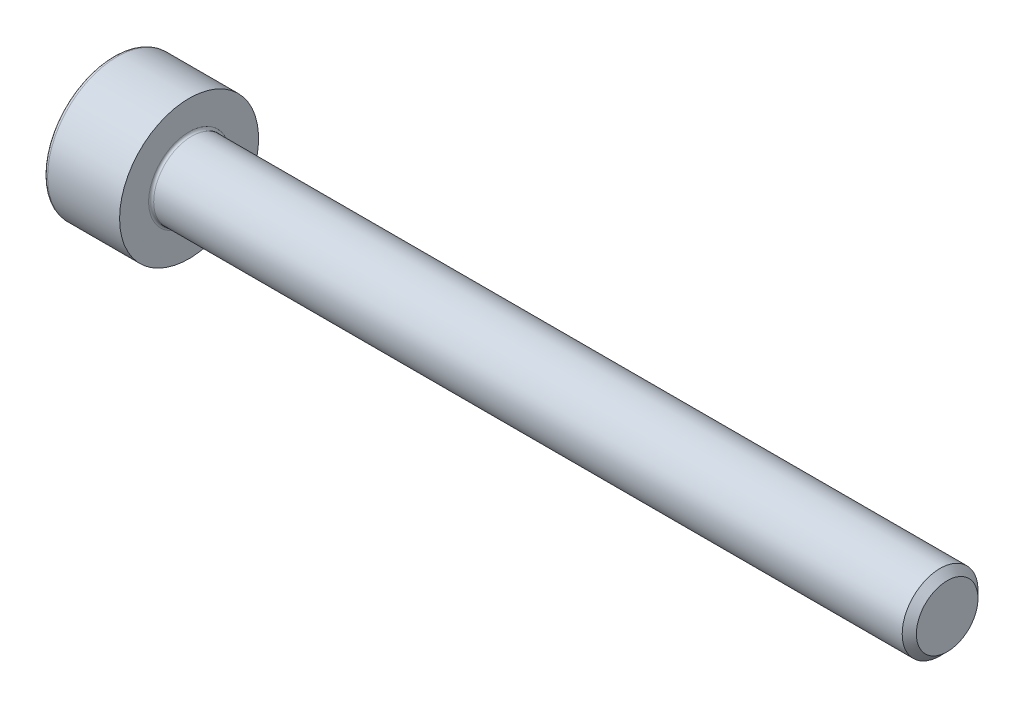
ISO-10303-21;
HEADER;
FILE_DESCRIPTION(('STEP AP214'),'2;1');
FILE_NAME('part.step','',(''),(''),'','','');
FILE_SCHEMA(('AUTOMOTIVE_DESIGN { 1 0 10303 214 1 1 1 1 }'));
ENDSEC;
DATA;
#1=APPLICATION_CONTEXT('core data for automotive mechanical design processes');
#2=APPLICATION_PROTOCOL_DEFINITION('international standard','automotive_design',2000,#1);
#3=PRODUCT_CONTEXT('',#1,'mechanical');
#4=PRODUCT('Part','Part','',(#3));
#5=PRODUCT_RELATED_PRODUCT_CATEGORY('part','',(#4));
#6=PRODUCT_DEFINITION_FORMATION('','',#4);
#7=PRODUCT_DEFINITION_CONTEXT('part definition',#1,'design');
#8=PRODUCT_DEFINITION('design','',#6,#7);
#9=PRODUCT_DEFINITION_SHAPE('','',#8);
#10=(LENGTH_UNIT() NAMED_UNIT(*) SI_UNIT(.MILLI.,.METRE.));
#11=(NAMED_UNIT(*) PLANE_ANGLE_UNIT() SI_UNIT($,.RADIAN.));
#12=(NAMED_UNIT(*) SI_UNIT($,.STERADIAN.) SOLID_ANGLE_UNIT());
#13=UNCERTAINTY_MEASURE_WITH_UNIT(LENGTH_MEASURE(1.E-05),#10,'distance_accuracy_value','');
#14=(GEOMETRIC_REPRESENTATION_CONTEXT(3) GLOBAL_UNCERTAINTY_ASSIGNED_CONTEXT((#13)) GLOBAL_UNIT_ASSIGNED_CONTEXT((#10,
#11,#12)) REPRESENTATION_CONTEXT('',''));
#15=CARTESIAN_POINT('',(0.,0.,0.));
#16=DIRECTION('',(0.,0.,1.));
#17=DIRECTION('',(1.,0.,0.));
#18=AXIS2_PLACEMENT_3D('',#15,#16,#17);
#19=CARTESIAN_POINT('',(0.,0.,0.));
#20=DIRECTION('',(-1.,0.,0.));
#21=DIRECTION('',(0.,0.,1.));
#22=AXIS2_PLACEMENT_3D('',#19,#20,#21);
#23=PLANE('',#22);
#24=DIRECTION('',(0.,-0.499999999999999,0.866025403784439));
#25=VECTOR('',#24,1.);
#26=CARTESIAN_POINT('',(0.,1.47801668912544,0.));
#27=LINE('',#26,#25);
#28=CARTESIAN_POINT('',(0.,1.47801668912544,0.));
#29=VERTEX_POINT('',#28);
#30=CARTESIAN_POINT('',(0.,0.739008344562719,1.28));
#31=VERTEX_POINT('',#30);
#32=EDGE_CURVE('E259',#29,#31,#27,.T.);
#33=ORIENTED_EDGE('',*,*,#32,.T.);
#34=DIRECTION('',(0.,1.,0.));
#35=VECTOR('',#34,1.);
#36=CARTESIAN_POINT('',(0.,-0.739008344562723,1.28));
#37=LINE('',#36,#35);
#38=CARTESIAN_POINT('',(0.,-0.739008344562723,1.28));
#39=VERTEX_POINT('',#38);
#40=EDGE_CURVE('E131',#39,#31,#37,.T.);
#41=ORIENTED_EDGE('',*,*,#40,.F.);
#42=DIRECTION('',(0.,-0.500000000000001,-0.866025403784438));
#43=VECTOR('',#42,1.);
#44=CARTESIAN_POINT('',(0.,-0.739008344562723,1.28));
#45=LINE('',#44,#43);
#46=CARTESIAN_POINT('',(0.,-1.47801668912545,0.));
#47=VERTEX_POINT('',#46);
#48=EDGE_CURVE('E262',#39,#47,#45,.T.);
#49=ORIENTED_EDGE('',*,*,#48,.T.);
#50=DIRECTION('',(0.,0.499999999999999,-0.866025403784439));
#51=VECTOR('',#50,1.);
#52=CARTESIAN_POINT('',(0.,-1.47801668912545,0.));
#53=LINE('',#52,#51);
#54=CARTESIAN_POINT('',(0.,-0.739008344562726,-1.28));
#55=VERTEX_POINT('',#54);
#56=EDGE_CURVE('E265',#47,#55,#53,.T.);
#57=ORIENTED_EDGE('',*,*,#56,.T.);
#58=DIRECTION('',(0.,-1.,0.));
#59=VECTOR('',#58,1.);
#60=CARTESIAN_POINT('',(0.,0.739008344562716,-1.28));
#61=LINE('',#60,#59);
#62=CARTESIAN_POINT('',(0.,0.739008344562716,-1.28));
#63=VERTEX_POINT('',#62);
#64=EDGE_CURVE('E268',#63,#55,#61,.T.);
#65=ORIENTED_EDGE('',*,*,#64,.F.);
#66=DIRECTION('',(0.,-0.500000000000001,-0.866025403784438));
#67=VECTOR('',#66,1.);
#68=CARTESIAN_POINT('',(0.,1.47801668912544,0.));
#69=LINE('',#68,#67);
#70=EDGE_CURVE('E126',#29,#63,#69,.T.);
#71=ORIENTED_EDGE('',*,*,#70,.F.);
#72=EDGE_LOOP('',(#33,#41,#49,#57,#65,#71));
#73=FACE_BOUND('',#72,.T.);
#74=CARTESIAN_POINT('',(0.,0.,0.));
#75=DIRECTION('',(-1.,0.,0.));
#76=DIRECTION('',(0.,0.,1.));
#77=AXIS2_PLACEMENT_3D('',#74,#75,#76);
#78=CIRCLE('',#77,2.6);
#79=CARTESIAN_POINT('',(0.,0.,2.6));
#80=VERTEX_POINT('',#79);
#81=EDGE_CURVE('E43',#80,#80,#78,.T.);
#82=ORIENTED_EDGE('',*,*,#81,.T.);
#83=EDGE_LOOP('',(#82));
#84=FACE_BOUND('',#83,.T.);
#85=ADVANCED_FACE('F35',(#73,#84),#23,.T.);
#86=CARTESIAN_POINT('',(-31.75,0.,0.));
#87=DIRECTION('',(-1.,0.,0.));
#88=DIRECTION('',(0.,0.,1.));
#89=AXIS2_PLACEMENT_3D('',#86,#87,#88);
#90=CYLINDRICAL_SURFACE('',#89,2.75);
#91=CARTESIAN_POINT('',(0.149999999999997,0.,0.));
#92=DIRECTION('',(-1.,0.,0.));
#93=DIRECTION('',(0.,0.,1.));
#94=AXIS2_PLACEMENT_3D('',#91,#92,#93);
#95=CIRCLE('',#94,2.75);
#96=CARTESIAN_POINT('',(0.149999999999997,0.,2.75));
#97=VERTEX_POINT('',#96);
#98=EDGE_CURVE('E11',#97,#97,#95,.F.);
#99=ORIENTED_EDGE('',*,*,#98,.T.);
#100=EDGE_LOOP('',(#99));
#101=FACE_BOUND('',#100,.T.);
#102=CARTESIAN_POINT('',(3.,0.,0.));
#103=DIRECTION('',(-1.,0.,0.));
#104=DIRECTION('',(0.,0.,1.));
#105=AXIS2_PLACEMENT_3D('',#102,#103,#104);
#106=CIRCLE('',#105,2.75);
#107=CARTESIAN_POINT('',(3.,0.,2.75));
#108=VERTEX_POINT('',#107);
#109=EDGE_CURVE('E149',#108,#108,#106,.T.);
#110=ORIENTED_EDGE('',*,*,#109,.T.);
#111=EDGE_LOOP('',(#110));
#112=FACE_BOUND('',#111,.T.);
#113=ADVANCED_FACE('F173',(#101,#112),#90,.T.);
#114=CARTESIAN_POINT('',(3.,2.75,0.));
#115=DIRECTION('',(1.,0.,0.));
#116=DIRECTION('',(0.,0.,-1.));
#117=AXIS2_PLACEMENT_3D('',#114,#115,#116);
#118=PLANE('',#117);
#119=CARTESIAN_POINT('',(3.,0.,0.));
#120=DIRECTION('',(1.,0.,0.));
#121=DIRECTION('',(0.,0.,-1.));
#122=AXIS2_PLACEMENT_3D('',#119,#120,#121);
#123=CIRCLE('',#122,1.6);
#124=CARTESIAN_POINT('',(3.,0.,-1.6));
#125=VERTEX_POINT('',#124);
#126=EDGE_CURVE('E152',#125,#125,#123,.F.);
#127=ORIENTED_EDGE('',*,*,#126,.T.);
#128=EDGE_LOOP('',(#127));
#129=FACE_BOUND('',#128,.T.);
#130=ORIENTED_EDGE('',*,*,#109,.F.);
#131=EDGE_LOOP('',(#130));
#132=FACE_BOUND('',#131,.T.);
#133=ADVANCED_FACE('F179',(#129,#132),#118,.T.);
#134=CARTESIAN_POINT('',(-31.75,0.,0.));
#135=DIRECTION('',(-1.,0.,0.));
#136=DIRECTION('',(0.,0.,1.));
#137=AXIS2_PLACEMENT_3D('',#134,#135,#136);
#138=CYLINDRICAL_SURFACE('',#137,1.5);
#139=CARTESIAN_POINT('',(3.1,0.,0.));
#140=DIRECTION('',(1.,0.,0.));
#141=DIRECTION('',(0.,0.,-1.));
#142=AXIS2_PLACEMENT_3D('',#139,#140,#141);
#143=CIRCLE('',#142,1.5);
#144=CARTESIAN_POINT('',(3.1,0.,-1.5));
#145=VERTEX_POINT('',#144);
#146=EDGE_CURVE('E155',#145,#145,#143,.T.);
#147=ORIENTED_EDGE('',*,*,#146,.T.);
#148=EDGE_LOOP('',(#147));
#149=FACE_BOUND('',#148,.T.);
#150=CARTESIAN_POINT('',(32.7195,0.,0.));
#151=DIRECTION('',(-1.,0.,0.));
#152=DIRECTION('',(0.,0.,1.));
#153=AXIS2_PLACEMENT_3D('',#150,#151,#152);
#154=CIRCLE('',#153,1.5);
#155=CARTESIAN_POINT('',(32.7195,0.,1.5));
#156=VERTEX_POINT('',#155);
#157=EDGE_CURVE('E146',#156,#156,#154,.T.);
#158=ORIENTED_EDGE('',*,*,#157,.T.);
#159=EDGE_LOOP('',(#158));
#160=FACE_BOUND('',#159,.T.);
#161=ADVANCED_FACE('F185',(#149,#160),#138,.T.);
#162=CARTESIAN_POINT('',(33.,0.,0.));
#163=DIRECTION('',(-1.,0.,0.));
#164=DIRECTION('',(0.,0.,1.));
#165=AXIS2_PLACEMENT_3D('',#162,#163,#164);
#166=CONICAL_SURFACE('',#165,1.2195,0.785398163397468);
#167=ORIENTED_EDGE('',*,*,#157,.F.);
#168=EDGE_LOOP('',(#167));
#169=FACE_BOUND('',#168,.T.);
#170=CARTESIAN_POINT('',(33.,0.,0.));
#171=DIRECTION('',(-1.,0.,0.));
#172=DIRECTION('',(0.,0.,1.));
#173=AXIS2_PLACEMENT_3D('',#170,#171,#172);
#174=CIRCLE('',#173,1.2195);
#175=CARTESIAN_POINT('',(33.,0.,1.2195));
#176=VERTEX_POINT('',#175);
#177=EDGE_CURVE('E142',#176,#176,#174,.T.);
#178=ORIENTED_EDGE('',*,*,#177,.T.);
#179=EDGE_LOOP('',(#178));
#180=FACE_BOUND('',#179,.T.);
#181=ADVANCED_FACE('F189',(#169,#180),#166,.T.);
#182=CARTESIAN_POINT('',(33.,1.2195,0.));
#183=DIRECTION('',(1.,0.,0.));
#184=DIRECTION('',(0.,0.,-1.));
#185=AXIS2_PLACEMENT_3D('',#182,#183,#184);
#186=PLANE('',#185);
#187=ORIENTED_EDGE('',*,*,#177,.F.);
#188=EDGE_LOOP('',(#187));
#189=FACE_BOUND('',#188,.T.);
#190=ADVANCED_FACE('F169',(#189),#186,.T.);
#191=CARTESIAN_POINT('',(3.1,0.,0.));
#192=DIRECTION('',(1.,0.,0.));
#193=DIRECTION('',(0.,0.,-1.));
#194=AXIS2_PLACEMENT_3D('',#191,#192,#193);
#195=TOROIDAL_SURFACE('',#194,1.6,0.1);
#196=ORIENTED_EDGE('',*,*,#146,.F.);
#197=EDGE_LOOP('',(#196));
#198=FACE_BOUND('',#197,.T.);
#199=ORIENTED_EDGE('',*,*,#126,.F.);
#200=EDGE_LOOP('',(#199));
#201=FACE_BOUND('',#200,.T.);
#202=ADVANCED_FACE('F162',(#198,#201),#195,.F.);
#203=CARTESIAN_POINT('',(0.149999999999997,0.,0.));
#204=DIRECTION('',(-1.,0.,0.));
#205=DIRECTION('',(0.,0.,1.));
#206=AXIS2_PLACEMENT_3D('',#203,#204,#205);
#207=TOROIDAL_SURFACE('',#206,2.6,0.15);
#208=ORIENTED_EDGE('',*,*,#98,.F.);
#209=EDGE_LOOP('',(#208));
#210=FACE_BOUND('',#209,.T.);
#211=ORIENTED_EDGE('',*,*,#81,.F.);
#212=EDGE_LOOP('',(#211));
#213=FACE_BOUND('',#212,.T.);
#214=ADVANCED_FACE('F37',(#210,#213),#207,.T.);
#215=CARTESIAN_POINT('',(1.3,1.47801668912544,0.));
#216=DIRECTION('',(0.,-0.866025403784439,-0.499999999999999));
#217=DIRECTION('',(0.,0.499999999999999,-0.866025403784439));
#218=AXIS2_PLACEMENT_3D('',#215,#216,#217);
#219=PLANE('',#218);
#220=ORIENTED_EDGE('',*,*,#32,.F.);
#221=DIRECTION('',(-1.,0.,0.));
#222=VECTOR('',#221,1.);
#223=CARTESIAN_POINT('',(1.3,1.47801668912544,0.));
#224=LINE('',#223,#222);
#225=CARTESIAN_POINT('',(1.3,1.47801668912544,0.));
#226=VERTEX_POINT('',#225);
#227=EDGE_CURVE('E249',#226,#29,#224,.T.);
#228=ORIENTED_EDGE('',*,*,#227,.F.);
#229=DIRECTION('',(0.,-0.499999999999999,0.866025403784439));
#230=VECTOR('',#229,1.);
#231=CARTESIAN_POINT('',(1.3,1.47801668912544,0.));
#232=LINE('',#231,#230);
#233=CARTESIAN_POINT('',(1.3,1.10851251684408,0.639999999999997));
#234=VERTEX_POINT('',#233);
#235=EDGE_CURVE('E118',#226,#234,#232,.T.);
#236=ORIENTED_EDGE('',*,*,#235,.T.);
#237=CARTESIAN_POINT('',(1.3,0.739008344562719,1.28));
#238=VERTEX_POINT('',#237);
#239=EDGE_CURVE('E109',#234,#238,#232,.T.);
#240=ORIENTED_EDGE('',*,*,#239,.T.);
#241=DIRECTION('',(-1.,0.,0.));
#242=VECTOR('',#241,1.);
#243=CARTESIAN_POINT('',(1.3,0.739008344562719,1.28));
#244=LINE('',#243,#242);
#245=EDGE_CURVE('E123',#238,#31,#244,.T.);
#246=ORIENTED_EDGE('',*,*,#245,.T.);
#247=EDGE_LOOP('',(#220,#228,#236,#240,#246));
#248=FACE_BOUND('',#247,.T.);
#249=ADVANCED_FACE('F122',(#248),#219,.T.);
#250=CARTESIAN_POINT('',(1.3,-0.739008344562723,1.28));
#251=DIRECTION('',(0.,0.,1.));
#252=DIRECTION('',(0.,-1.,0.));
#253=AXIS2_PLACEMENT_3D('',#250,#251,#252);
#254=PLANE('',#253);
#255=ORIENTED_EDGE('',*,*,#40,.T.);
#256=ORIENTED_EDGE('',*,*,#245,.F.);
#257=DIRECTION('',(0.,1.,0.));
#258=VECTOR('',#257,1.);
#259=CARTESIAN_POINT('',(1.3,-0.739008344562723,1.28));
#260=LINE('',#259,#258);
#261=CARTESIAN_POINT('',(1.3,0.,1.28));
#262=VERTEX_POINT('',#261);
#263=EDGE_CURVE('E106',#262,#238,#260,.T.);
#264=ORIENTED_EDGE('',*,*,#263,.F.);
#265=CARTESIAN_POINT('',(1.3,-0.739008344562723,1.28));
#266=VERTEX_POINT('',#265);
#267=EDGE_CURVE('E117',#266,#262,#260,.T.);
#268=ORIENTED_EDGE('',*,*,#267,.F.);
#269=DIRECTION('',(-1.,0.,0.));
#270=VECTOR('',#269,1.);
#271=CARTESIAN_POINT('',(1.3,-0.739008344562723,1.28));
#272=LINE('',#271,#270);
#273=EDGE_CURVE('E133',#266,#39,#272,.T.);
#274=ORIENTED_EDGE('',*,*,#273,.T.);
#275=EDGE_LOOP('',(#255,#256,#264,#268,#274));
#276=FACE_BOUND('',#275,.T.);
#277=ADVANCED_FACE('F128',(#276),#254,.F.);
#278=CARTESIAN_POINT('',(1.3,-0.739008344562723,1.28));
#279=DIRECTION('',(0.,0.866025403784438,-0.500000000000001));
#280=DIRECTION('',(0.,0.500000000000001,0.866025403784438));
#281=AXIS2_PLACEMENT_3D('',#278,#279,#280);
#282=PLANE('',#281);
#283=ORIENTED_EDGE('',*,*,#48,.F.);
#284=ORIENTED_EDGE('',*,*,#273,.F.);
#285=DIRECTION('',(0.,-0.500000000000001,-0.866025403784438));
#286=VECTOR('',#285,1.);
#287=CARTESIAN_POINT('',(1.3,-0.739008344562723,1.28));
#288=LINE('',#287,#286);
#289=CARTESIAN_POINT('',(1.3,-1.10851251684408,0.640000000000003));
#290=VERTEX_POINT('',#289);
#291=EDGE_CURVE('E288',#266,#290,#288,.T.);
#292=ORIENTED_EDGE('',*,*,#291,.T.);
#293=CARTESIAN_POINT('',(1.3,-1.47801668912545,0.));
#294=VERTEX_POINT('',#293);
#295=EDGE_CURVE('E277',#290,#294,#288,.T.);
#296=ORIENTED_EDGE('',*,*,#295,.T.);
#297=DIRECTION('',(-1.,0.,0.));
#298=VECTOR('',#297,1.);
#299=CARTESIAN_POINT('',(1.3,-1.47801668912545,0.));
#300=LINE('',#299,#298);
#301=EDGE_CURVE('E138',#294,#47,#300,.T.);
#302=ORIENTED_EDGE('',*,*,#301,.T.);
#303=EDGE_LOOP('',(#283,#284,#292,#296,#302));
#304=FACE_BOUND('',#303,.T.);
#305=ADVANCED_FACE('F203',(#304),#282,.T.);
#306=CARTESIAN_POINT('',(1.3,-1.47801668912545,0.));
#307=DIRECTION('',(0.,0.866025403784439,0.499999999999999));
#308=DIRECTION('',(0.,-0.499999999999999,0.866025403784439));
#309=AXIS2_PLACEMENT_3D('',#306,#307,#308);
#310=PLANE('',#309);
#311=ORIENTED_EDGE('',*,*,#56,.F.);
#312=ORIENTED_EDGE('',*,*,#301,.F.);
#313=DIRECTION('',(0.,0.499999999999999,-0.866025403784439));
#314=VECTOR('',#313,1.);
#315=CARTESIAN_POINT('',(1.3,-1.47801668912545,0.));
#316=LINE('',#315,#314);
#317=CARTESIAN_POINT('',(1.3,-1.10851251684409,-0.640000000000001));
#318=VERTEX_POINT('',#317);
#319=EDGE_CURVE('E255',#294,#318,#316,.T.);
#320=ORIENTED_EDGE('',*,*,#319,.T.);
#321=CARTESIAN_POINT('',(1.3,-0.739008344562726,-1.28));
#322=VERTEX_POINT('',#321);
#323=EDGE_CURVE('E287',#318,#322,#316,.T.);
#324=ORIENTED_EDGE('',*,*,#323,.T.);
#325=DIRECTION('',(-1.,0.,0.));
#326=VECTOR('',#325,1.);
#327=CARTESIAN_POINT('',(1.3,-0.739008344562726,-1.28));
#328=LINE('',#327,#326);
#329=EDGE_CURVE('E248',#322,#55,#328,.T.);
#330=ORIENTED_EDGE('',*,*,#329,.T.);
#331=EDGE_LOOP('',(#311,#312,#320,#324,#330));
#332=FACE_BOUND('',#331,.T.);
#333=ADVANCED_FACE('F206',(#332),#310,.T.);
#334=CARTESIAN_POINT('',(1.3,0.739008344562716,-1.28));
#335=DIRECTION('',(0.,0.,-1.));
#336=DIRECTION('',(0.,1.,0.));
#337=AXIS2_PLACEMENT_3D('',#334,#335,#336);
#338=PLANE('',#337);
#339=ORIENTED_EDGE('',*,*,#64,.T.);
#340=ORIENTED_EDGE('',*,*,#329,.F.);
#341=DIRECTION('',(0.,-1.,0.));
#342=VECTOR('',#341,1.);
#343=CARTESIAN_POINT('',(1.3,0.739008344562716,-1.28));
#344=LINE('',#343,#342);
#345=CARTESIAN_POINT('',(1.3,0.,-1.28));
#346=VERTEX_POINT('',#345);
#347=EDGE_CURVE('E252',#346,#322,#344,.T.);
#348=ORIENTED_EDGE('',*,*,#347,.F.);
#349=CARTESIAN_POINT('',(1.3,0.739008344562716,-1.28));
#350=VERTEX_POINT('',#349);
#351=EDGE_CURVE('E50',#350,#346,#344,.T.);
#352=ORIENTED_EDGE('',*,*,#351,.F.);
#353=DIRECTION('',(-1.,0.,0.));
#354=VECTOR('',#353,1.);
#355=CARTESIAN_POINT('',(1.3,0.739008344562716,-1.28));
#356=LINE('',#355,#354);
#357=EDGE_CURVE('E245',#350,#63,#356,.T.);
#358=ORIENTED_EDGE('',*,*,#357,.T.);
#359=EDGE_LOOP('',(#339,#340,#348,#352,#358));
#360=FACE_BOUND('',#359,.T.);
#361=ADVANCED_FACE('F210',(#360),#338,.F.);
#362=CARTESIAN_POINT('',(1.3,1.47801668912544,0.));
#363=DIRECTION('',(0.,0.866025403784438,-0.500000000000001));
#364=DIRECTION('',(0.,0.500000000000001,0.866025403784438));
#365=AXIS2_PLACEMENT_3D('',#362,#363,#364);
#366=PLANE('',#365);
#367=ORIENTED_EDGE('',*,*,#70,.T.);
#368=ORIENTED_EDGE('',*,*,#357,.F.);
#369=DIRECTION('',(0.,-0.500000000000001,-0.866025403784438));
#370=VECTOR('',#369,1.);
#371=CARTESIAN_POINT('',(1.3,1.47801668912544,0.));
#372=LINE('',#371,#370);
#373=CARTESIAN_POINT('',(1.3,1.10851251684408,-0.640000000000001));
#374=VERTEX_POINT('',#373);
#375=EDGE_CURVE('E235',#374,#350,#372,.T.);
#376=ORIENTED_EDGE('',*,*,#375,.F.);
#377=EDGE_CURVE('E241',#226,#374,#372,.T.);
#378=ORIENTED_EDGE('',*,*,#377,.F.);
#379=ORIENTED_EDGE('',*,*,#227,.T.);
#380=EDGE_LOOP('',(#367,#368,#376,#378,#379));
#381=FACE_BOUND('',#380,.T.);
#382=ADVANCED_FACE('F214',(#381),#366,.F.);
#383=CARTESIAN_POINT('',(1.3,1.47801668912544,0.));
#384=DIRECTION('',(1.,0.,0.));
#385=DIRECTION('',(0.,0.,-1.));
#386=AXIS2_PLACEMENT_3D('',#383,#384,#385);
#387=PLANE('',#386);
#388=ORIENTED_EDGE('',*,*,#347,.T.);
#389=ORIENTED_EDGE('',*,*,#323,.F.);
#390=CARTESIAN_POINT('',(1.3,0.,0.));
#391=DIRECTION('',(-1.,0.,0.));
#392=DIRECTION('',(0.,0.,1.));
#393=AXIS2_PLACEMENT_3D('',#390,#391,#392);
#394=CIRCLE('',#393,1.28);
#395=EDGE_CURVE('E283',#346,#318,#394,.T.);
#396=ORIENTED_EDGE('',*,*,#395,.F.);
#397=EDGE_LOOP('',(#388,#389,#396));
#398=FACE_BOUND('',#397,.T.);
#399=ADVANCED_FACE('F218',(#398),#387,.F.);
#400=ORIENTED_EDGE('',*,*,#319,.F.);
#401=ORIENTED_EDGE('',*,*,#295,.F.);
#402=EDGE_CURVE('E136',#318,#290,#394,.T.);
#403=ORIENTED_EDGE('',*,*,#402,.F.);
#404=EDGE_LOOP('',(#400,#401,#403));
#405=FACE_BOUND('',#404,.T.);
#406=ADVANCED_FACE('F221',(#405),#387,.F.);
#407=ORIENTED_EDGE('',*,*,#291,.F.);
#408=ORIENTED_EDGE('',*,*,#267,.T.);
#409=EDGE_CURVE('E132',#290,#262,#394,.T.);
#410=ORIENTED_EDGE('',*,*,#409,.F.);
#411=EDGE_LOOP('',(#407,#408,#410));
#412=FACE_BOUND('',#411,.T.);
#413=ADVANCED_FACE('F226',(#412),#387,.F.);
#414=ORIENTED_EDGE('',*,*,#263,.T.);
#415=ORIENTED_EDGE('',*,*,#239,.F.);
#416=EDGE_CURVE('E112',#262,#234,#394,.T.);
#417=ORIENTED_EDGE('',*,*,#416,.F.);
#418=EDGE_LOOP('',(#414,#415,#417));
#419=FACE_BOUND('',#418,.T.);
#420=ADVANCED_FACE('F108',(#419),#387,.F.);
#421=ORIENTED_EDGE('',*,*,#235,.F.);
#422=ORIENTED_EDGE('',*,*,#377,.T.);
#423=EDGE_CURVE('E143',#234,#374,#394,.T.);
#424=ORIENTED_EDGE('',*,*,#423,.F.);
#425=EDGE_LOOP('',(#421,#422,#424));
#426=FACE_BOUND('',#425,.T.);
#427=ADVANCED_FACE('F229',(#426),#387,.F.);
#428=ORIENTED_EDGE('',*,*,#375,.T.);
#429=ORIENTED_EDGE('',*,*,#351,.T.);
#430=EDGE_CURVE('E238',#374,#346,#394,.T.);
#431=ORIENTED_EDGE('',*,*,#430,.F.);
#432=EDGE_LOOP('',(#428,#429,#431));
#433=FACE_BOUND('',#432,.T.);
#434=ADVANCED_FACE('F199',(#433),#387,.F.);
#435=CARTESIAN_POINT('',(1.3,0.,0.));
#436=DIRECTION('',(-1.,0.,0.));
#437=DIRECTION('',(0.,0.,1.));
#438=AXIS2_PLACEMENT_3D('',#435,#436,#437);
#439=CONICAL_SURFACE('',#438,1.28,1.04719755119659);
#440=CARTESIAN_POINT('',(2.03900834456273,0.,0.));
#441=VERTEX_POINT('',#440);
#442=VERTEX_LOOP('',#441);
#443=FACE_BOUND('',#442,.T.);
#444=ORIENTED_EDGE('',*,*,#416,.T.);
#445=ORIENTED_EDGE('',*,*,#423,.T.);
#446=ORIENTED_EDGE('',*,*,#430,.T.);
#447=ORIENTED_EDGE('',*,*,#395,.T.);
#448=ORIENTED_EDGE('',*,*,#402,.T.);
#449=ORIENTED_EDGE('',*,*,#409,.T.);
#450=EDGE_LOOP('',(#444,#445,#446,#447,#448,#449));
#451=FACE_BOUND('',#450,.T.);
#452=ADVANCED_FACE('F197',(#443,#451),#439,.F.);
#453=CLOSED_SHELL('',(#85,#113,#133,#161,#181,#190,#202,#214,#249,#277,#305,#333,#361,#382,#399,
#406,#413,#420,#427,#434,#452));
#454=MANIFOLD_SOLID_BREP('B2',#453);
#455=ADVANCED_BREP_SHAPE_REPRESENTATION('',(#18,#454),#14);
#456=SHAPE_DEFINITION_REPRESENTATION(#9,#455);
ENDSEC;
END-ISO-10303-21;
